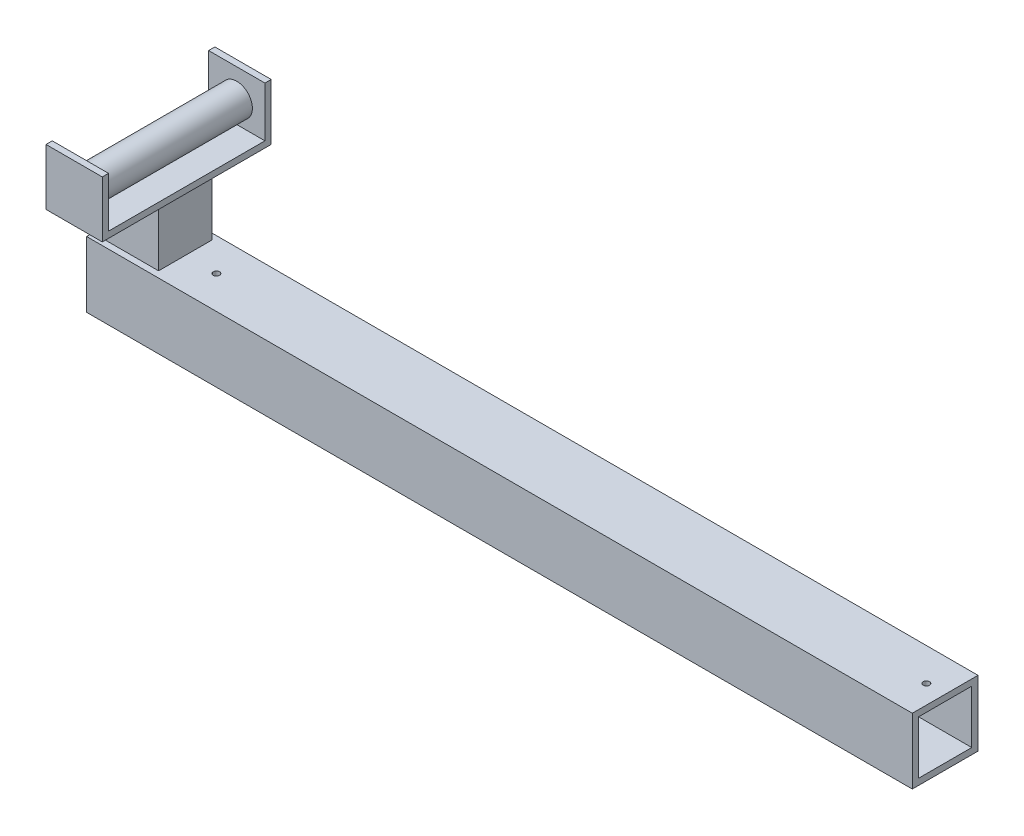
ISO-10303-21;
HEADER;
FILE_DESCRIPTION(('STEP AP214'),'2;1');
FILE_NAME('part.step','',(''),(''),'','','');
FILE_SCHEMA(('AUTOMOTIVE_DESIGN { 1 0 10303 214 1 1 1 1 }'));
ENDSEC;
DATA;
#1=APPLICATION_CONTEXT('core data for automotive mechanical design processes');
#2=APPLICATION_PROTOCOL_DEFINITION('international standard','automotive_design',2000,#1);
#3=PRODUCT_CONTEXT('',#1,'mechanical');
#4=PRODUCT('Part','Part','',(#3));
#5=PRODUCT_RELATED_PRODUCT_CATEGORY('part','',(#4));
#6=PRODUCT_DEFINITION_FORMATION('','',#4);
#7=PRODUCT_DEFINITION_CONTEXT('part definition',#1,'design');
#8=PRODUCT_DEFINITION('design','',#6,#7);
#9=PRODUCT_DEFINITION_SHAPE('','',#8);
#10=(LENGTH_UNIT() NAMED_UNIT(*) SI_UNIT(.MILLI.,.METRE.));
#11=(NAMED_UNIT(*) PLANE_ANGLE_UNIT() SI_UNIT($,.RADIAN.));
#12=(NAMED_UNIT(*) SI_UNIT($,.STERADIAN.) SOLID_ANGLE_UNIT());
#13=UNCERTAINTY_MEASURE_WITH_UNIT(LENGTH_MEASURE(1.E-05),#10,'distance_accuracy_value','');
#14=(GEOMETRIC_REPRESENTATION_CONTEXT(3) GLOBAL_UNCERTAINTY_ASSIGNED_CONTEXT((#13)) GLOBAL_UNIT_ASSIGNED_CONTEXT((#10,
#11,#12)) REPRESENTATION_CONTEXT('',''));
#15=CARTESIAN_POINT('',(0.,0.,0.));
#16=DIRECTION('',(0.,0.,1.));
#17=DIRECTION('',(1.,0.,0.));
#18=AXIS2_PLACEMENT_3D('',#15,#16,#17);
#19=CARTESIAN_POINT('',(0.,260.35,0.));
#20=DIRECTION('',(0.,-1.,0.));
#21=DIRECTION('',(0.,0.,-1.));
#22=AXIS2_PLACEMENT_3D('',#19,#20,#21);
#23=PLANE('',#22);
#24=DIRECTION('',(-1.,0.,0.));
#25=VECTOR('',#24,1.);
#26=CARTESIAN_POINT('',(25.4,260.35,228.6));
#27=LINE('',#26,#25);
#28=CARTESIAN_POINT('',(139.7,260.35,228.6));
#29=VERTEX_POINT('',#28);
#30=CARTESIAN_POINT('',(25.4,260.35,228.6));
#31=VERTEX_POINT('',#30);
#32=EDGE_CURVE('E197',#29,#31,#27,.T.);
#33=ORIENTED_EDGE('',*,*,#32,.F.);
#34=DIRECTION('',(0.,0.,-1.));
#35=VECTOR('',#34,1.);
#36=CARTESIAN_POINT('',(139.7,260.35,241.3));
#37=LINE('',#36,#35);
#38=CARTESIAN_POINT('',(139.7,260.35,-88.9));
#39=VERTEX_POINT('',#38);
#40=EDGE_CURVE('E231',#29,#39,#37,.T.);
#41=ORIENTED_EDGE('',*,*,#40,.T.);
#42=DIRECTION('',(1.,0.,0.));
#43=VECTOR('',#42,1.);
#44=CARTESIAN_POINT('',(25.4,260.35,-88.9));
#45=LINE('',#44,#43);
#46=CARTESIAN_POINT('',(25.4,260.35,-88.9));
#47=VERTEX_POINT('',#46);
#48=EDGE_CURVE('E54',#47,#39,#45,.T.);
#49=ORIENTED_EDGE('',*,*,#48,.F.);
#50=DIRECTION('',(0.,0.,1.));
#51=VECTOR('',#50,1.);
#52=CARTESIAN_POINT('',(25.4,260.35,241.3));
#53=LINE('',#52,#51);
#54=EDGE_CURVE('E49',#47,#31,#53,.T.);
#55=ORIENTED_EDGE('',*,*,#54,.T.);
#56=EDGE_LOOP('',(#33,#41,#49,#55));
#57=FACE_BOUND('',#56,.T.);
#58=ADVANCED_FACE('F34',(#57),#23,.F.);
#59=CARTESIAN_POINT('',(0.,133.35,133.35));
#60=DIRECTION('',(0.,1.,0.));
#61=DIRECTION('',(0.,0.,1.));
#62=AXIS2_PLACEMENT_3D('',#59,#60,#61);
#63=PLANE('',#62);
#64=CARTESIAN_POINT('',(196.85,133.35,66.675));
#65=DIRECTION('',(0.,1.,0.));
#66=DIRECTION('',(0.,0.,1.));
#67=AXIS2_PLACEMENT_3D('',#64,#65,#66);
#68=CIRCLE('',#67,6.34999999999999);
#69=CARTESIAN_POINT('',(196.85,133.35,73.025));
#70=VERTEX_POINT('',#69);
#71=EDGE_CURVE('E662',#70,#70,#68,.T.);
#72=ORIENTED_EDGE('',*,*,#71,.F.);
#73=EDGE_LOOP('',(#72));
#74=FACE_BOUND('',#73,.T.);
#75=CARTESIAN_POINT('',(1638.3,133.35,66.675));
#76=DIRECTION('',(0.,1.,0.));
#77=DIRECTION('',(0.,0.,1.));
#78=AXIS2_PLACEMENT_3D('',#75,#76,#77);
#79=CIRCLE('',#78,6.35000000000016);
#80=CARTESIAN_POINT('',(1638.3,133.35,73.0250000000002));
#81=VERTEX_POINT('',#80);
#82=EDGE_CURVE('E667',#81,#81,#79,.T.);
#83=ORIENTED_EDGE('',*,*,#82,.F.);
#84=EDGE_LOOP('',(#83));
#85=FACE_BOUND('',#84,.T.);
#86=DIRECTION('',(1.,0.,0.));
#87=VECTOR('',#86,1.);
#88=CARTESIAN_POINT('',(0.,133.35,0.));
#89=LINE('',#88,#87);
#90=CARTESIAN_POINT('',(0.,133.35,0.));
#91=VERTEX_POINT('',#90);
#92=CARTESIAN_POINT('',(1676.4,133.35,0.));
#93=VERTEX_POINT('',#92);
#94=EDGE_CURVE('E324',#91,#93,#89,.T.);
#95=ORIENTED_EDGE('',*,*,#94,.F.);
#96=DIRECTION('',(0.,0.,-1.));
#97=VECTOR('',#96,1.);
#98=CARTESIAN_POINT('',(0.,133.35,133.35));
#99=LINE('',#98,#97);
#100=CARTESIAN_POINT('',(0.,133.35,133.35));
#101=VERTEX_POINT('',#100);
#102=EDGE_CURVE('E321',#101,#91,#99,.T.);
#103=ORIENTED_EDGE('',*,*,#102,.F.);
#104=DIRECTION('',(1.,0.,0.));
#105=VECTOR('',#104,1.);
#106=CARTESIAN_POINT('',(0.,133.35,133.35));
#107=LINE('',#106,#105);
#108=CARTESIAN_POINT('',(1676.4,133.35,133.35));
#109=VERTEX_POINT('',#108);
#110=EDGE_CURVE('E313',#101,#109,#107,.T.);
#111=ORIENTED_EDGE('',*,*,#110,.T.);
#112=DIRECTION('',(0.,0.,-1.));
#113=VECTOR('',#112,1.);
#114=CARTESIAN_POINT('',(1676.4,133.35,133.35));
#115=LINE('',#114,#113);
#116=EDGE_CURVE('E336',#109,#93,#115,.T.);
#117=ORIENTED_EDGE('',*,*,#116,.T.);
#118=EDGE_LOOP('',(#95,#103,#111,#117));
#119=FACE_BOUND('',#118,.T.);
#120=DIRECTION('',(1.,0.,0.));
#121=VECTOR('',#120,1.);
#122=CARTESIAN_POINT('',(25.4,133.35,120.65));
#123=LINE('',#122,#121);
#124=CARTESIAN_POINT('',(25.4,133.35,120.65));
#125=VERTEX_POINT('',#124);
#126=CARTESIAN_POINT('',(133.35,133.35,120.65));
#127=VERTEX_POINT('',#126);
#128=EDGE_CURVE('E261',#125,#127,#123,.T.);
#129=ORIENTED_EDGE('',*,*,#128,.F.);
#130=DIRECTION('',(0.,0.,1.));
#131=VECTOR('',#130,1.);
#132=CARTESIAN_POINT('',(25.4,133.35,12.7));
#133=LINE('',#132,#131);
#134=CARTESIAN_POINT('',(25.4,133.35,12.7));
#135=VERTEX_POINT('',#134);
#136=EDGE_CURVE('E182',#135,#125,#133,.T.);
#137=ORIENTED_EDGE('',*,*,#136,.F.);
#138=DIRECTION('',(-1.,0.,0.));
#139=VECTOR('',#138,1.);
#140=CARTESIAN_POINT('',(25.4,133.35,12.7));
#141=LINE('',#140,#139);
#142=CARTESIAN_POINT('',(133.35,133.35,12.7));
#143=VERTEX_POINT('',#142);
#144=EDGE_CURVE('E253',#143,#135,#141,.T.);
#145=ORIENTED_EDGE('',*,*,#144,.F.);
#146=DIRECTION('',(0.,0.,-1.));
#147=VECTOR('',#146,1.);
#148=CARTESIAN_POINT('',(133.35,133.35,12.7));
#149=LINE('',#148,#147);
#150=EDGE_CURVE('E263',#127,#143,#149,.T.);
#151=ORIENTED_EDGE('',*,*,#150,.F.);
#152=EDGE_LOOP('',(#129,#137,#145,#151));
#153=FACE_BOUND('',#152,.T.);
#154=ADVANCED_FACE('F371',(#74,#85,#119,#153),#63,.T.);
#155=CARTESIAN_POINT('',(1676.4,0.,133.35));
#156=DIRECTION('',(-1.,0.,0.));
#157=DIRECTION('',(0.,0.,1.));
#158=AXIS2_PLACEMENT_3D('',#155,#156,#157);
#159=PLANE('',#158);
#160=DIRECTION('',(0.,1.,0.));
#161=VECTOR('',#160,1.);
#162=CARTESIAN_POINT('',(1676.4,0.,0.));
#163=LINE('',#162,#161);
#164=CARTESIAN_POINT('',(1676.4,0.,0.));
#165=VERTEX_POINT('',#164);
#166=EDGE_CURVE('E327',#165,#93,#163,.T.);
#167=ORIENTED_EDGE('',*,*,#166,.T.);
#168=ORIENTED_EDGE('',*,*,#116,.F.);
#169=DIRECTION('',(0.,1.,0.));
#170=VECTOR('',#169,1.);
#171=CARTESIAN_POINT('',(1676.4,0.,133.35));
#172=LINE('',#171,#170);
#173=CARTESIAN_POINT('',(1676.4,0.,133.35));
#174=VERTEX_POINT('',#173);
#175=EDGE_CURVE('E317',#174,#109,#172,.T.);
#176=ORIENTED_EDGE('',*,*,#175,.F.);
#177=DIRECTION('',(0.,0.,-1.));
#178=VECTOR('',#177,1.);
#179=CARTESIAN_POINT('',(1676.4,0.,133.35));
#180=LINE('',#179,#178);
#181=EDGE_CURVE('E333',#174,#165,#180,.T.);
#182=ORIENTED_EDGE('',*,*,#181,.T.);
#183=EDGE_LOOP('',(#167,#168,#176,#182));
#184=FACE_BOUND('',#183,.T.);
#185=DIRECTION('',(0.,1.,0.));
#186=VECTOR('',#185,1.);
#187=CARTESIAN_POINT('',(1676.4,12.7,120.65));
#188=LINE('',#187,#186);
#189=CARTESIAN_POINT('',(1676.4,12.7,120.65));
#190=VERTEX_POINT('',#189);
#191=CARTESIAN_POINT('',(1676.4,120.65,120.65));
#192=VERTEX_POINT('',#191);
#193=EDGE_CURVE('E276',#190,#192,#188,.T.);
#194=ORIENTED_EDGE('',*,*,#193,.T.);
#195=DIRECTION('',(0.,0.,-1.));
#196=VECTOR('',#195,1.);
#197=CARTESIAN_POINT('',(1676.4,120.65,120.65));
#198=LINE('',#197,#196);
#199=CARTESIAN_POINT('',(1676.4,120.65,12.7));
#200=VERTEX_POINT('',#199);
#201=EDGE_CURVE('E292',#192,#200,#198,.T.);
#202=ORIENTED_EDGE('',*,*,#201,.T.);
#203=DIRECTION('',(0.,1.,0.));
#204=VECTOR('',#203,1.);
#205=CARTESIAN_POINT('',(1676.4,12.7,12.7));
#206=LINE('',#205,#204);
#207=CARTESIAN_POINT('',(1676.4,12.7,12.7));
#208=VERTEX_POINT('',#207);
#209=EDGE_CURVE('E295',#208,#200,#206,.T.);
#210=ORIENTED_EDGE('',*,*,#209,.F.);
#211=DIRECTION('',(0.,0.,-1.));
#212=VECTOR('',#211,1.);
#213=CARTESIAN_POINT('',(1676.4,12.7,120.65));
#214=LINE('',#213,#212);
#215=EDGE_CURVE('E281',#190,#208,#214,.T.);
#216=ORIENTED_EDGE('',*,*,#215,.F.);
#217=EDGE_LOOP('',(#194,#202,#210,#216));
#218=FACE_BOUND('',#217,.T.);
#219=ADVANCED_FACE('F384',(#184,#218),#159,.F.);
#220=CARTESIAN_POINT('',(0.,0.,133.35));
#221=DIRECTION('',(-1.,0.,0.));
#222=DIRECTION('',(0.,0.,1.));
#223=AXIS2_PLACEMENT_3D('',#220,#221,#222);
#224=PLANE('',#223);
#225=DIRECTION('',(0.,1.,0.));
#226=VECTOR('',#225,1.);
#227=CARTESIAN_POINT('',(0.,0.,0.));
#228=LINE('',#227,#226);
#229=CARTESIAN_POINT('',(0.,0.,0.));
#230=VERTEX_POINT('',#229);
#231=EDGE_CURVE('E309',#230,#91,#228,.T.);
#232=ORIENTED_EDGE('',*,*,#231,.F.);
#233=DIRECTION('',(0.,0.,-1.));
#234=VECTOR('',#233,1.);
#235=CARTESIAN_POINT('',(0.,0.,133.35));
#236=LINE('',#235,#234);
#237=CARTESIAN_POINT('',(0.,0.,133.35));
#238=VERTEX_POINT('',#237);
#239=EDGE_CURVE('E331',#238,#230,#236,.T.);
#240=ORIENTED_EDGE('',*,*,#239,.F.);
#241=DIRECTION('',(0.,1.,0.));
#242=VECTOR('',#241,1.);
#243=CARTESIAN_POINT('',(0.,0.,133.35));
#244=LINE('',#243,#242);
#245=EDGE_CURVE('E310',#238,#101,#244,.T.);
#246=ORIENTED_EDGE('',*,*,#245,.T.);
#247=ORIENTED_EDGE('',*,*,#102,.T.);
#248=EDGE_LOOP('',(#232,#240,#246,#247));
#249=FACE_BOUND('',#248,.T.);
#250=ADVANCED_FACE('F36',(#249),#224,.T.);
#251=CARTESIAN_POINT('',(0.,0.,133.35));
#252=DIRECTION('',(0.,1.,0.));
#253=DIRECTION('',(0.,0.,1.));
#254=AXIS2_PLACEMENT_3D('',#251,#252,#253);
#255=PLANE('',#254);
#256=DIRECTION('',(1.,0.,0.));
#257=VECTOR('',#256,1.);
#258=CARTESIAN_POINT('',(0.,0.,0.));
#259=LINE('',#258,#257);
#260=EDGE_CURVE('E314',#230,#165,#259,.T.);
#261=ORIENTED_EDGE('',*,*,#260,.T.);
#262=ORIENTED_EDGE('',*,*,#181,.F.);
#263=DIRECTION('',(1.,0.,0.));
#264=VECTOR('',#263,1.);
#265=CARTESIAN_POINT('',(0.,0.,133.35));
#266=LINE('',#265,#264);
#267=EDGE_CURVE('E319',#238,#174,#266,.T.);
#268=ORIENTED_EDGE('',*,*,#267,.F.);
#269=ORIENTED_EDGE('',*,*,#239,.T.);
#270=EDGE_LOOP('',(#261,#262,#268,#269));
#271=FACE_BOUND('',#270,.T.);
#272=ADVANCED_FACE('F430',(#271),#255,.F.);
#273=CARTESIAN_POINT('',(0.,0.,133.35));
#274=DIRECTION('',(0.,0.,-1.));
#275=DIRECTION('',(-1.,0.,0.));
#276=AXIS2_PLACEMENT_3D('',#273,#274,#275);
#277=PLANE('',#276);
#278=ORIENTED_EDGE('',*,*,#245,.F.);
#279=ORIENTED_EDGE('',*,*,#267,.T.);
#280=ORIENTED_EDGE('',*,*,#175,.T.);
#281=ORIENTED_EDGE('',*,*,#110,.F.);
#282=EDGE_LOOP('',(#278,#279,#280,#281));
#283=FACE_BOUND('',#282,.T.);
#284=ADVANCED_FACE('F427',(#283),#277,.F.);
#285=CARTESIAN_POINT('',(0.,0.,0.));
#286=DIRECTION('',(0.,0.,-1.));
#287=DIRECTION('',(-1.,0.,0.));
#288=AXIS2_PLACEMENT_3D('',#285,#286,#287);
#289=PLANE('',#288);
#290=ORIENTED_EDGE('',*,*,#231,.T.);
#291=ORIENTED_EDGE('',*,*,#94,.T.);
#292=ORIENTED_EDGE('',*,*,#166,.F.);
#293=ORIENTED_EDGE('',*,*,#260,.F.);
#294=EDGE_LOOP('',(#290,#291,#292,#293));
#295=FACE_BOUND('',#294,.T.);
#296=ADVANCED_FACE('F425',(#295),#289,.T.);
#297=CARTESIAN_POINT('',(152.4,12.7,120.65));
#298=DIRECTION('',(0.,0.,-1.));
#299=DIRECTION('',(-1.,0.,0.));
#300=AXIS2_PLACEMENT_3D('',#297,#298,#299);
#301=PLANE('',#300);
#302=ORIENTED_EDGE('',*,*,#193,.F.);
#303=DIRECTION('',(1.,0.,0.));
#304=VECTOR('',#303,1.);
#305=CARTESIAN_POINT('',(152.4,12.7,120.65));
#306=LINE('',#305,#304);
#307=CARTESIAN_POINT('',(152.4,12.7,120.65));
#308=VERTEX_POINT('',#307);
#309=EDGE_CURVE('E289',#308,#190,#306,.T.);
#310=ORIENTED_EDGE('',*,*,#309,.F.);
#311=DIRECTION('',(0.,1.,0.));
#312=VECTOR('',#311,1.);
#313=CARTESIAN_POINT('',(152.4,12.7,120.65));
#314=LINE('',#313,#312);
#315=CARTESIAN_POINT('',(152.4,120.65,120.65));
#316=VERTEX_POINT('',#315);
#317=EDGE_CURVE('E277',#308,#316,#314,.T.);
#318=ORIENTED_EDGE('',*,*,#317,.T.);
#319=DIRECTION('',(1.,0.,0.));
#320=VECTOR('',#319,1.);
#321=CARTESIAN_POINT('',(152.4,120.65,120.65));
#322=LINE('',#321,#320);
#323=EDGE_CURVE('E306',#316,#192,#322,.T.);
#324=ORIENTED_EDGE('',*,*,#323,.T.);
#325=EDGE_LOOP('',(#302,#310,#318,#324));
#326=FACE_BOUND('',#325,.T.);
#327=ADVANCED_FACE('F421',(#326),#301,.T.);
#328=CARTESIAN_POINT('',(152.4,120.65,120.65));
#329=DIRECTION('',(0.,-1.,0.));
#330=DIRECTION('',(0.,0.,-1.));
#331=AXIS2_PLACEMENT_3D('',#328,#329,#330);
#332=PLANE('',#331);
#333=CARTESIAN_POINT('',(196.85,120.65,66.675));
#334=DIRECTION('',(0.,-1.,0.));
#335=DIRECTION('',(0.,0.,-1.));
#336=AXIS2_PLACEMENT_3D('',#333,#334,#335);
#337=CIRCLE('',#336,6.34999999999999);
#338=CARTESIAN_POINT('',(196.85,120.65,60.325));
#339=VERTEX_POINT('',#338);
#340=EDGE_CURVE('E199',#339,#339,#337,.F.);
#341=ORIENTED_EDGE('',*,*,#340,.T.);
#342=EDGE_LOOP('',(#341));
#343=FACE_BOUND('',#342,.T.);
#344=CARTESIAN_POINT('',(1638.3,120.65,66.675));
#345=DIRECTION('',(0.,-1.,0.));
#346=DIRECTION('',(0.,0.,-1.));
#347=AXIS2_PLACEMENT_3D('',#344,#345,#346);
#348=CIRCLE('',#347,6.35000000000016);
#349=CARTESIAN_POINT('',(1638.3,120.65,60.3249999999998));
#350=VERTEX_POINT('',#349);
#351=EDGE_CURVE('E202',#350,#350,#348,.F.);
#352=ORIENTED_EDGE('',*,*,#351,.T.);
#353=EDGE_LOOP('',(#352));
#354=FACE_BOUND('',#353,.T.);
#355=ORIENTED_EDGE('',*,*,#201,.F.);
#356=ORIENTED_EDGE('',*,*,#323,.F.);
#357=DIRECTION('',(0.,0.,-1.));
#358=VECTOR('',#357,1.);
#359=CARTESIAN_POINT('',(152.4,120.65,120.65));
#360=LINE('',#359,#358);
#361=CARTESIAN_POINT('',(152.4,120.65,12.7));
#362=VERTEX_POINT('',#361);
#363=EDGE_CURVE('E280',#316,#362,#360,.T.);
#364=ORIENTED_EDGE('',*,*,#363,.T.);
#365=DIRECTION('',(1.,0.,0.));
#366=VECTOR('',#365,1.);
#367=CARTESIAN_POINT('',(152.4,120.65,12.7));
#368=LINE('',#367,#366);
#369=EDGE_CURVE('E304',#362,#200,#368,.T.);
#370=ORIENTED_EDGE('',*,*,#369,.T.);
#371=EDGE_LOOP('',(#355,#356,#364,#370));
#372=FACE_BOUND('',#371,.T.);
#373=ADVANCED_FACE('F417',(#343,#354,#372),#332,.T.);
#374=CARTESIAN_POINT('',(152.4,12.7,12.7));
#375=DIRECTION('',(0.,0.,-1.));
#376=DIRECTION('',(0.,1.,0.));
#377=AXIS2_PLACEMENT_3D('',#374,#375,#376);
#378=PLANE('',#377);
#379=ORIENTED_EDGE('',*,*,#209,.T.);
#380=ORIENTED_EDGE('',*,*,#369,.F.);
#381=DIRECTION('',(0.,1.,0.));
#382=VECTOR('',#381,1.);
#383=CARTESIAN_POINT('',(152.4,12.7,12.7));
#384=LINE('',#383,#382);
#385=CARTESIAN_POINT('',(152.4,12.7,12.7));
#386=VERTEX_POINT('',#385);
#387=EDGE_CURVE('E283',#386,#362,#384,.T.);
#388=ORIENTED_EDGE('',*,*,#387,.F.);
#389=DIRECTION('',(1.,0.,0.));
#390=VECTOR('',#389,1.);
#391=CARTESIAN_POINT('',(152.4,12.7,12.7));
#392=LINE('',#391,#390);
#393=EDGE_CURVE('E302',#386,#208,#392,.T.);
#394=ORIENTED_EDGE('',*,*,#393,.T.);
#395=EDGE_LOOP('',(#379,#380,#388,#394));
#396=FACE_BOUND('',#395,.T.);
#397=ADVANCED_FACE('F413',(#396),#378,.F.);
#398=CARTESIAN_POINT('',(152.4,12.7,120.65));
#399=DIRECTION('',(0.,-1.,0.));
#400=DIRECTION('',(0.,0.,-1.));
#401=AXIS2_PLACEMENT_3D('',#398,#399,#400);
#402=PLANE('',#401);
#403=ORIENTED_EDGE('',*,*,#215,.T.);
#404=ORIENTED_EDGE('',*,*,#393,.F.);
#405=DIRECTION('',(0.,0.,-1.));
#406=VECTOR('',#405,1.);
#407=CARTESIAN_POINT('',(152.4,12.7,120.65));
#408=LINE('',#407,#406);
#409=EDGE_CURVE('E286',#308,#386,#408,.T.);
#410=ORIENTED_EDGE('',*,*,#409,.F.);
#411=ORIENTED_EDGE('',*,*,#309,.T.);
#412=EDGE_LOOP('',(#403,#404,#410,#411));
#413=FACE_BOUND('',#412,.T.);
#414=ADVANCED_FACE('F409',(#413),#402,.F.);
#415=CARTESIAN_POINT('',(152.4,0.,0.));
#416=DIRECTION('',(-1.,0.,0.));
#417=DIRECTION('',(0.,0.,1.));
#418=AXIS2_PLACEMENT_3D('',#415,#416,#417);
#419=PLANE('',#418);
#420=ORIENTED_EDGE('',*,*,#317,.F.);
#421=ORIENTED_EDGE('',*,*,#409,.T.);
#422=ORIENTED_EDGE('',*,*,#387,.T.);
#423=ORIENTED_EDGE('',*,*,#363,.F.);
#424=EDGE_LOOP('',(#420,#421,#422,#423));
#425=FACE_BOUND('',#424,.T.);
#426=ADVANCED_FACE('F406',(#425),#419,.F.);
#427=CARTESIAN_POINT('',(25.4,247.65,12.7));
#428=DIRECTION('',(1.,0.,0.));
#429=DIRECTION('',(0.,0.,-1.));
#430=AXIS2_PLACEMENT_3D('',#427,#428,#429);
#431=PLANE('',#430);
#432=ORIENTED_EDGE('',*,*,#136,.T.);
#433=DIRECTION('',(0.,-1.,0.));
#434=VECTOR('',#433,1.);
#435=CARTESIAN_POINT('',(25.4,247.65,120.65));
#436=LINE('',#435,#434);
#437=CARTESIAN_POINT('',(25.4,247.65,120.65));
#438=VERTEX_POINT('',#437);
#439=EDGE_CURVE('E274',#438,#125,#436,.T.);
#440=ORIENTED_EDGE('',*,*,#439,.F.);
#441=DIRECTION('',(0.,0.,1.));
#442=VECTOR('',#441,1.);
#443=CARTESIAN_POINT('',(25.4,247.65,241.3));
#444=LINE('',#443,#442);
#445=CARTESIAN_POINT('',(25.4,247.65,241.3));
#446=VERTEX_POINT('',#445);
#447=EDGE_CURVE('E179',#438,#446,#444,.T.);
#448=ORIENTED_EDGE('',*,*,#447,.T.);
#449=DIRECTION('',(0.,-1.,0.));
#450=VECTOR('',#449,1.);
#451=CARTESIAN_POINT('',(25.4,260.35,241.3));
#452=LINE('',#451,#450);
#453=CARTESIAN_POINT('',(25.4,361.95,241.3));
#454=VERTEX_POINT('',#453);
#455=EDGE_CURVE('E170',#454,#446,#452,.T.);
#456=ORIENTED_EDGE('',*,*,#455,.F.);
#457=DIRECTION('',(0.,0.,1.));
#458=VECTOR('',#457,1.);
#459=CARTESIAN_POINT('',(25.4,361.95,241.3));
#460=LINE('',#459,#458);
#461=CARTESIAN_POINT('',(25.4,361.95,228.6));
#462=VERTEX_POINT('',#461);
#463=EDGE_CURVE('E176',#462,#454,#460,.T.);
#464=ORIENTED_EDGE('',*,*,#463,.F.);
#465=DIRECTION('',(0.,-1.,0.));
#466=VECTOR('',#465,1.);
#467=CARTESIAN_POINT('',(25.4,361.95,228.6));
#468=LINE('',#467,#466);
#469=EDGE_CURVE('E206',#462,#31,#468,.T.);
#470=ORIENTED_EDGE('',*,*,#469,.T.);
#471=ORIENTED_EDGE('',*,*,#54,.F.);
#472=DIRECTION('',(0.,-1.,0.));
#473=VECTOR('',#472,1.);
#474=CARTESIAN_POINT('',(25.4,361.95,-88.9));
#475=LINE('',#474,#473);
#476=CARTESIAN_POINT('',(25.4,361.95,-88.9));
#477=VERTEX_POINT('',#476);
#478=EDGE_CURVE('E227',#477,#47,#475,.T.);
#479=ORIENTED_EDGE('',*,*,#478,.F.);
#480=DIRECTION('',(0.,0.,1.));
#481=VECTOR('',#480,1.);
#482=CARTESIAN_POINT('',(25.4,361.95,-101.6));
#483=LINE('',#482,#481);
#484=CARTESIAN_POINT('',(25.4,361.95,-101.6));
#485=VERTEX_POINT('',#484);
#486=EDGE_CURVE('E212',#485,#477,#483,.T.);
#487=ORIENTED_EDGE('',*,*,#486,.F.);
#488=DIRECTION('',(0.,-1.,0.));
#489=VECTOR('',#488,1.);
#490=CARTESIAN_POINT('',(25.4,260.35,-101.6));
#491=LINE('',#490,#489);
#492=CARTESIAN_POINT('',(25.4,247.65,-101.6));
#493=VERTEX_POINT('',#492);
#494=EDGE_CURVE('E234',#485,#493,#491,.T.);
#495=ORIENTED_EDGE('',*,*,#494,.T.);
#496=CARTESIAN_POINT('',(25.4,247.65,12.7));
#497=VERTEX_POINT('',#496);
#498=EDGE_CURVE('E235',#493,#497,#444,.T.);
#499=ORIENTED_EDGE('',*,*,#498,.T.);
#500=DIRECTION('',(0.,-1.,0.));
#501=VECTOR('',#500,1.);
#502=CARTESIAN_POINT('',(25.4,247.65,12.7));
#503=LINE('',#502,#501);
#504=EDGE_CURVE('E259',#497,#135,#503,.T.);
#505=ORIENTED_EDGE('',*,*,#504,.T.);
#506=EDGE_LOOP('',(#432,#440,#448,#456,#464,#470,#471,#479,#487,#495,#499,#505));
#507=FACE_BOUND('',#506,.T.);
#508=ADVANCED_FACE('F173',(#507),#431,.F.);
#509=CARTESIAN_POINT('',(25.4,247.65,120.65));
#510=DIRECTION('',(0.,0.,-1.));
#511=DIRECTION('',(-1.,0.,0.));
#512=AXIS2_PLACEMENT_3D('',#509,#510,#511);
#513=PLANE('',#512);
#514=ORIENTED_EDGE('',*,*,#128,.T.);
#515=DIRECTION('',(0.,-1.,0.));
#516=VECTOR('',#515,1.);
#517=CARTESIAN_POINT('',(133.35,247.65,120.65));
#518=LINE('',#517,#516);
#519=CARTESIAN_POINT('',(133.35,247.65,120.65));
#520=VERTEX_POINT('',#519);
#521=EDGE_CURVE('E271',#520,#127,#518,.T.);
#522=ORIENTED_EDGE('',*,*,#521,.F.);
#523=DIRECTION('',(1.,0.,0.));
#524=VECTOR('',#523,1.);
#525=CARTESIAN_POINT('',(25.4,247.65,120.65));
#526=LINE('',#525,#524);
#527=EDGE_CURVE('E249',#438,#520,#526,.T.);
#528=ORIENTED_EDGE('',*,*,#527,.F.);
#529=ORIENTED_EDGE('',*,*,#439,.T.);
#530=EDGE_LOOP('',(#514,#522,#528,#529));
#531=FACE_BOUND('',#530,.T.);
#532=ADVANCED_FACE('F374',(#531),#513,.F.);
#533=CARTESIAN_POINT('',(133.35,247.65,12.7));
#534=DIRECTION('',(-1.,0.,0.));
#535=DIRECTION('',(0.,0.,1.));
#536=AXIS2_PLACEMENT_3D('',#533,#534,#535);
#537=PLANE('',#536);
#538=ORIENTED_EDGE('',*,*,#150,.T.);
#539=DIRECTION('',(0.,-1.,0.));
#540=VECTOR('',#539,1.);
#541=CARTESIAN_POINT('',(133.35,247.65,12.7));
#542=LINE('',#541,#540);
#543=CARTESIAN_POINT('',(133.35,247.65,12.7));
#544=VERTEX_POINT('',#543);
#545=EDGE_CURVE('E269',#544,#143,#542,.T.);
#546=ORIENTED_EDGE('',*,*,#545,.F.);
#547=DIRECTION('',(0.,0.,-1.));
#548=VECTOR('',#547,1.);
#549=CARTESIAN_POINT('',(133.35,247.65,12.7));
#550=LINE('',#549,#548);
#551=EDGE_CURVE('E252',#520,#544,#550,.T.);
#552=ORIENTED_EDGE('',*,*,#551,.F.);
#553=ORIENTED_EDGE('',*,*,#521,.T.);
#554=EDGE_LOOP('',(#538,#546,#552,#553));
#555=FACE_BOUND('',#554,.T.);
#556=ADVANCED_FACE('F376',(#555),#537,.F.);
#557=CARTESIAN_POINT('',(25.4,247.65,12.7));
#558=DIRECTION('',(0.,0.,1.));
#559=DIRECTION('',(1.,0.,0.));
#560=AXIS2_PLACEMENT_3D('',#557,#558,#559);
#561=PLANE('',#560);
#562=ORIENTED_EDGE('',*,*,#144,.T.);
#563=ORIENTED_EDGE('',*,*,#504,.F.);
#564=DIRECTION('',(-1.,0.,0.));
#565=VECTOR('',#564,1.);
#566=CARTESIAN_POINT('',(25.4,247.65,12.7));
#567=LINE('',#566,#565);
#568=EDGE_CURVE('E256',#544,#497,#567,.T.);
#569=ORIENTED_EDGE('',*,*,#568,.F.);
#570=ORIENTED_EDGE('',*,*,#545,.T.);
#571=EDGE_LOOP('',(#562,#563,#569,#570));
#572=FACE_BOUND('',#571,.T.);
#573=ADVANCED_FACE('F366',(#572),#561,.F.);
#574=CARTESIAN_POINT('',(25.4,260.35,241.3));
#575=DIRECTION('',(0.,0.,-1.));
#576=DIRECTION('',(-1.,0.,0.));
#577=AXIS2_PLACEMENT_3D('',#574,#575,#576);
#578=PLANE('',#577);
#579=DIRECTION('',(1.,0.,0.));
#580=VECTOR('',#579,1.);
#581=CARTESIAN_POINT('',(25.4,247.65,241.3));
#582=LINE('',#581,#580);
#583=CARTESIAN_POINT('',(139.7,247.65,241.3));
#584=VERTEX_POINT('',#583);
#585=EDGE_CURVE('E238',#446,#584,#582,.T.);
#586=ORIENTED_EDGE('',*,*,#585,.T.);
#587=DIRECTION('',(0.,-1.,0.));
#588=VECTOR('',#587,1.);
#589=CARTESIAN_POINT('',(139.7,260.35,241.3));
#590=LINE('',#589,#588);
#591=CARTESIAN_POINT('',(139.7,361.95,241.3));
#592=VERTEX_POINT('',#591);
#593=EDGE_CURVE('E183',#592,#584,#590,.T.);
#594=ORIENTED_EDGE('',*,*,#593,.F.);
#595=DIRECTION('',(1.,0.,0.));
#596=VECTOR('',#595,1.);
#597=CARTESIAN_POINT('',(25.4,361.95,241.3));
#598=LINE('',#597,#596);
#599=EDGE_CURVE('E186',#454,#592,#598,.T.);
#600=ORIENTED_EDGE('',*,*,#599,.F.);
#601=ORIENTED_EDGE('',*,*,#455,.T.);
#602=EDGE_LOOP('',(#586,#594,#600,#601));
#603=FACE_BOUND('',#602,.T.);
#604=ADVANCED_FACE('F187',(#603),#578,.F.);
#605=CARTESIAN_POINT('',(139.7,260.35,241.3));
#606=DIRECTION('',(-1.,0.,0.));
#607=DIRECTION('',(0.,0.,1.));
#608=AXIS2_PLACEMENT_3D('',#605,#606,#607);
#609=PLANE('',#608);
#610=DIRECTION('',(0.,0.,-1.));
#611=VECTOR('',#610,1.);
#612=CARTESIAN_POINT('',(139.7,247.65,241.3));
#613=LINE('',#612,#611);
#614=CARTESIAN_POINT('',(139.7,247.65,-101.6));
#615=VERTEX_POINT('',#614);
#616=EDGE_CURVE('E240',#584,#615,#613,.T.);
#617=ORIENTED_EDGE('',*,*,#616,.T.);
#618=DIRECTION('',(0.,-1.,0.));
#619=VECTOR('',#618,1.);
#620=CARTESIAN_POINT('',(139.7,260.35,-101.6));
#621=LINE('',#620,#619);
#622=CARTESIAN_POINT('',(139.7,361.95,-101.6));
#623=VERTEX_POINT('',#622);
#624=EDGE_CURVE('E245',#623,#615,#621,.T.);
#625=ORIENTED_EDGE('',*,*,#624,.F.);
#626=DIRECTION('',(0.,0.,-1.));
#627=VECTOR('',#626,1.);
#628=CARTESIAN_POINT('',(139.7,361.95,-101.6));
#629=LINE('',#628,#627);
#630=CARTESIAN_POINT('',(139.7,361.95,-88.9));
#631=VERTEX_POINT('',#630);
#632=EDGE_CURVE('E217',#631,#623,#629,.T.);
#633=ORIENTED_EDGE('',*,*,#632,.F.);
#634=DIRECTION('',(0.,-1.,0.));
#635=VECTOR('',#634,1.);
#636=CARTESIAN_POINT('',(139.7,361.95,-88.9));
#637=LINE('',#636,#635);
#638=EDGE_CURVE('E223',#631,#39,#637,.T.);
#639=ORIENTED_EDGE('',*,*,#638,.T.);
#640=ORIENTED_EDGE('',*,*,#40,.F.);
#641=DIRECTION('',(0.,-1.,0.));
#642=VECTOR('',#641,1.);
#643=CARTESIAN_POINT('',(139.7,361.95,228.6));
#644=LINE('',#643,#642);
#645=CARTESIAN_POINT('',(139.7,361.95,228.6));
#646=VERTEX_POINT('',#645);
#647=EDGE_CURVE('E209',#646,#29,#644,.T.);
#648=ORIENTED_EDGE('',*,*,#647,.F.);
#649=DIRECTION('',(0.,0.,-1.));
#650=VECTOR('',#649,1.);
#651=CARTESIAN_POINT('',(139.7,361.95,241.3));
#652=LINE('',#651,#650);
#653=EDGE_CURVE('E191',#592,#646,#652,.T.);
#654=ORIENTED_EDGE('',*,*,#653,.F.);
#655=ORIENTED_EDGE('',*,*,#593,.T.);
#656=EDGE_LOOP('',(#617,#625,#633,#639,#640,#648,#654,#655));
#657=FACE_BOUND('',#656,.T.);
#658=ADVANCED_FACE('F378',(#657),#609,.F.);
#659=CARTESIAN_POINT('',(25.4,260.35,-101.6));
#660=DIRECTION('',(0.,0.,1.));
#661=DIRECTION('',(1.,0.,0.));
#662=AXIS2_PLACEMENT_3D('',#659,#660,#661);
#663=PLANE('',#662);
#664=DIRECTION('',(-1.,0.,0.));
#665=VECTOR('',#664,1.);
#666=CARTESIAN_POINT('',(25.4,247.65,-101.6));
#667=LINE('',#666,#665);
#668=EDGE_CURVE('E232',#615,#493,#667,.T.);
#669=ORIENTED_EDGE('',*,*,#668,.T.);
#670=ORIENTED_EDGE('',*,*,#494,.F.);
#671=DIRECTION('',(-1.,0.,0.));
#672=VECTOR('',#671,1.);
#673=CARTESIAN_POINT('',(25.4,361.95,-101.6));
#674=LINE('',#673,#672);
#675=EDGE_CURVE('E220',#623,#485,#674,.T.);
#676=ORIENTED_EDGE('',*,*,#675,.F.);
#677=ORIENTED_EDGE('',*,*,#624,.T.);
#678=EDGE_LOOP('',(#669,#670,#676,#677));
#679=FACE_BOUND('',#678,.T.);
#680=ADVANCED_FACE('F391',(#679),#663,.F.);
#681=CARTESIAN_POINT('',(0.,247.65,0.));
#682=DIRECTION('',(0.,-1.,0.));
#683=DIRECTION('',(0.,0.,-1.));
#684=AXIS2_PLACEMENT_3D('',#681,#682,#683);
#685=PLANE('',#684);
#686=ORIENTED_EDGE('',*,*,#447,.F.);
#687=ORIENTED_EDGE('',*,*,#527,.T.);
#688=ORIENTED_EDGE('',*,*,#551,.T.);
#689=ORIENTED_EDGE('',*,*,#568,.T.);
#690=ORIENTED_EDGE('',*,*,#498,.F.);
#691=ORIENTED_EDGE('',*,*,#668,.F.);
#692=ORIENTED_EDGE('',*,*,#616,.F.);
#693=ORIENTED_EDGE('',*,*,#585,.F.);
#694=EDGE_LOOP('',(#686,#687,#688,#689,#690,#691,#692,#693));
#695=FACE_BOUND('',#694,.T.);
#696=ADVANCED_FACE('F361',(#695),#685,.T.);
#697=CARTESIAN_POINT('',(25.4,361.95,-88.9));
#698=DIRECTION('',(0.,0.,-1.));
#699=DIRECTION('',(-1.,0.,0.));
#700=AXIS2_PLACEMENT_3D('',#697,#698,#699);
#701=PLANE('',#700);
#702=CARTESIAN_POINT('',(82.55,304.8,-88.9));
#703=DIRECTION('',(0.,0.,-1.));
#704=DIRECTION('',(-1.,0.,0.));
#705=AXIS2_PLACEMENT_3D('',#702,#703,#704);
#706=CIRCLE('',#705,31.75);
#707=CARTESIAN_POINT('',(50.8,304.8,-88.9));
#708=VERTEX_POINT('',#707);
#709=EDGE_CURVE('E11',#708,#708,#706,.F.);
#710=ORIENTED_EDGE('',*,*,#709,.F.);
#711=EDGE_LOOP('',(#710));
#712=FACE_BOUND('',#711,.T.);
#713=ORIENTED_EDGE('',*,*,#48,.T.);
#714=ORIENTED_EDGE('',*,*,#638,.F.);
#715=DIRECTION('',(1.,0.,0.));
#716=VECTOR('',#715,1.);
#717=CARTESIAN_POINT('',(25.4,361.95,-88.9));
#718=LINE('',#717,#716);
#719=EDGE_CURVE('E215',#477,#631,#718,.T.);
#720=ORIENTED_EDGE('',*,*,#719,.F.);
#721=ORIENTED_EDGE('',*,*,#478,.T.);
#722=EDGE_LOOP('',(#713,#714,#720,#721));
#723=FACE_BOUND('',#722,.T.);
#724=ADVANCED_FACE('F352',(#712,#723),#701,.F.);
#725=CARTESIAN_POINT('',(0.,361.95,0.));
#726=DIRECTION('',(0.,1.,0.));
#727=DIRECTION('',(0.,0.,1.));
#728=AXIS2_PLACEMENT_3D('',#725,#726,#727);
#729=PLANE('',#728);
#730=ORIENTED_EDGE('',*,*,#486,.T.);
#731=ORIENTED_EDGE('',*,*,#719,.T.);
#732=ORIENTED_EDGE('',*,*,#632,.T.);
#733=ORIENTED_EDGE('',*,*,#675,.T.);
#734=EDGE_LOOP('',(#730,#731,#732,#733));
#735=FACE_BOUND('',#734,.T.);
#736=ADVANCED_FACE('F346',(#735),#729,.T.);
#737=CARTESIAN_POINT('',(25.4,361.95,228.6));
#738=DIRECTION('',(0.,0.,1.));
#739=DIRECTION('',(1.,0.,0.));
#740=AXIS2_PLACEMENT_3D('',#737,#738,#739);
#741=PLANE('',#740);
#742=CARTESIAN_POINT('',(82.55,304.8,228.6));
#743=DIRECTION('',(0.,0.,1.));
#744=DIRECTION('',(1.,0.,0.));
#745=AXIS2_PLACEMENT_3D('',#742,#743,#744);
#746=CIRCLE('',#745,31.75);
#747=CARTESIAN_POINT('',(114.3,304.8,228.6));
#748=VERTEX_POINT('',#747);
#749=EDGE_CURVE('E42',#748,#748,#746,.F.);
#750=ORIENTED_EDGE('',*,*,#749,.F.);
#751=EDGE_LOOP('',(#750));
#752=FACE_BOUND('',#751,.T.);
#753=ORIENTED_EDGE('',*,*,#32,.T.);
#754=ORIENTED_EDGE('',*,*,#469,.F.);
#755=DIRECTION('',(-1.,0.,0.));
#756=VECTOR('',#755,1.);
#757=CARTESIAN_POINT('',(25.4,361.95,228.6));
#758=LINE('',#757,#756);
#759=EDGE_CURVE('E195',#646,#462,#758,.T.);
#760=ORIENTED_EDGE('',*,*,#759,.F.);
#761=ORIENTED_EDGE('',*,*,#647,.T.);
#762=EDGE_LOOP('',(#753,#754,#760,#761));
#763=FACE_BOUND('',#762,.T.);
#764=ADVANCED_FACE('F343',(#752,#763),#741,.F.);
#765=CARTESIAN_POINT('',(0.,361.95,0.));
#766=DIRECTION('',(0.,-1.,0.));
#767=DIRECTION('',(0.,0.,-1.));
#768=AXIS2_PLACEMENT_3D('',#765,#766,#767);
#769=PLANE('',#768);
#770=ORIENTED_EDGE('',*,*,#463,.T.);
#771=ORIENTED_EDGE('',*,*,#599,.T.);
#772=ORIENTED_EDGE('',*,*,#653,.T.);
#773=ORIENTED_EDGE('',*,*,#759,.T.);
#774=EDGE_LOOP('',(#770,#771,#772,#773));
#775=FACE_BOUND('',#774,.T.);
#776=ADVANCED_FACE('F193',(#775),#769,.F.);
#777=CARTESIAN_POINT('',(82.55,304.8,318.402561210692));
#778=DIRECTION('',(0.,0.,-1.));
#779=DIRECTION('',(-1.,0.,0.));
#780=AXIS2_PLACEMENT_3D('',#777,#778,#779);
#781=CYLINDRICAL_SURFACE('',#780,31.75);
#782=ORIENTED_EDGE('',*,*,#709,.T.);
#783=EDGE_LOOP('',(#782));
#784=FACE_BOUND('',#783,.T.);
#785=ORIENTED_EDGE('',*,*,#749,.T.);
#786=EDGE_LOOP('',(#785));
#787=FACE_BOUND('',#786,.T.);
#788=ADVANCED_FACE('F341',(#784,#787),#781,.T.);
#789=CARTESIAN_POINT('',(1638.3,102.689487757861,66.675));
#790=DIRECTION('',(0.,1.,0.));
#791=DIRECTION('',(0.,0.,1.));
#792=AXIS2_PLACEMENT_3D('',#789,#790,#791);
#793=CYLINDRICAL_SURFACE('',#792,6.35000000000016);
#794=ORIENTED_EDGE('',*,*,#82,.T.);
#795=EDGE_LOOP('',(#794));
#796=FACE_BOUND('',#795,.T.);
#797=ORIENTED_EDGE('',*,*,#351,.F.);
#798=EDGE_LOOP('',(#797));
#799=FACE_BOUND('',#798,.T.);
#800=ADVANCED_FACE('F559',(#796,#799),#793,.F.);
#801=CARTESIAN_POINT('',(196.85,102.689487757861,66.675));
#802=DIRECTION('',(0.,1.,0.));
#803=DIRECTION('',(0.,0.,1.));
#804=AXIS2_PLACEMENT_3D('',#801,#802,#803);
#805=CYLINDRICAL_SURFACE('',#804,6.34999999999999);
#806=ORIENTED_EDGE('',*,*,#71,.T.);
#807=EDGE_LOOP('',(#806));
#808=FACE_BOUND('',#807,.T.);
#809=ORIENTED_EDGE('',*,*,#340,.F.);
#810=EDGE_LOOP('',(#809));
#811=FACE_BOUND('',#810,.T.);
#812=ADVANCED_FACE('F566',(#808,#811),#805,.F.);
#813=CLOSED_SHELL('',(#58,#154,#219,#250,#272,#284,#296,#327,#373,#397,#414,#426,#508,#532,#556,
#573,#604,#658,#680,#696,#724,#736,#764,#776,#788,#800,#812));
#814=MANIFOLD_SOLID_BREP('B2',#813);
#815=ADVANCED_BREP_SHAPE_REPRESENTATION('',(#18,#814),#14);
#816=SHAPE_DEFINITION_REPRESENTATION(#9,#815);
ENDSEC;
END-ISO-10303-21;
